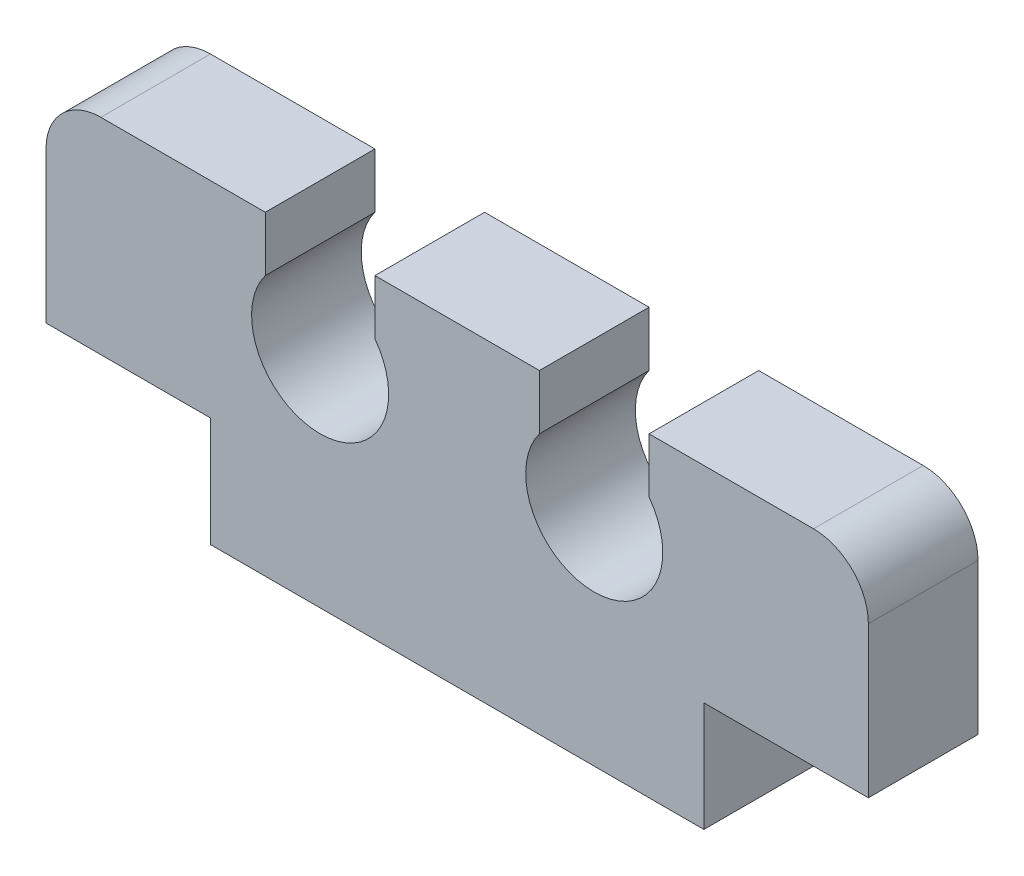
ISO-10303-21;
HEADER;
FILE_DESCRIPTION(('STEP AP214'),'2;1');
FILE_NAME('part.step','',(''),(''),'','','');
FILE_SCHEMA(('AUTOMOTIVE_DESIGN { 1 0 10303 214 1 1 1 1 }'));
ENDSEC;
DATA;
#1=APPLICATION_CONTEXT('core data for automotive mechanical design processes');
#2=APPLICATION_PROTOCOL_DEFINITION('international standard','automotive_design',2000,#1);
#3=PRODUCT_CONTEXT('',#1,'mechanical');
#4=PRODUCT('Part','Part','',(#3));
#5=PRODUCT_RELATED_PRODUCT_CATEGORY('part','',(#4));
#6=PRODUCT_DEFINITION_FORMATION('','',#4);
#7=PRODUCT_DEFINITION_CONTEXT('part definition',#1,'design');
#8=PRODUCT_DEFINITION('design','',#6,#7);
#9=PRODUCT_DEFINITION_SHAPE('','',#8);
#10=(LENGTH_UNIT() NAMED_UNIT(*) SI_UNIT(.MILLI.,.METRE.));
#11=(NAMED_UNIT(*) PLANE_ANGLE_UNIT() SI_UNIT($,.RADIAN.));
#12=(NAMED_UNIT(*) SI_UNIT($,.STERADIAN.) SOLID_ANGLE_UNIT());
#13=UNCERTAINTY_MEASURE_WITH_UNIT(LENGTH_MEASURE(1.E-05),#10,'distance_accuracy_value','');
#14=(GEOMETRIC_REPRESENTATION_CONTEXT(3) GLOBAL_UNCERTAINTY_ASSIGNED_CONTEXT((#13)) GLOBAL_UNIT_ASSIGNED_CONTEXT((#10,
#11,#12)) REPRESENTATION_CONTEXT('',''));
#15=CARTESIAN_POINT('',(0.,0.,0.));
#16=DIRECTION('',(0.,0.,1.));
#17=DIRECTION('',(1.,0.,0.));
#18=AXIS2_PLACEMENT_3D('',#15,#16,#17);
#19=CARTESIAN_POINT('',(-4.5,0.,2.));
#20=DIRECTION('',(1.,0.,0.));
#21=DIRECTION('',(0.,0.,-1.));
#22=AXIS2_PLACEMENT_3D('',#19,#20,#21);
#23=PLANE('',#22);
#24=DIRECTION('',(0.,-1.,0.));
#25=VECTOR('',#24,1.);
#26=CARTESIAN_POINT('',(-4.5,0.,0.));
#27=LINE('',#26,#25);
#28=CARTESIAN_POINT('',(-4.5,2.,0.));
#29=VERTEX_POINT('',#28);
#30=CARTESIAN_POINT('',(-4.5,0.,0.));
#31=VERTEX_POINT('',#30);
#32=EDGE_CURVE('E181',#29,#31,#27,.T.);
#33=ORIENTED_EDGE('',*,*,#32,.T.);
#34=DIRECTION('',(0.,0.,-1.));
#35=VECTOR('',#34,1.);
#36=CARTESIAN_POINT('',(-4.5,0.,2.));
#37=LINE('',#36,#35);
#38=CARTESIAN_POINT('',(-4.5,0.,2.));
#39=VERTEX_POINT('',#38);
#40=EDGE_CURVE('E162',#39,#31,#37,.T.);
#41=ORIENTED_EDGE('',*,*,#40,.F.);
#42=DIRECTION('',(0.,-1.,0.));
#43=VECTOR('',#42,1.);
#44=CARTESIAN_POINT('',(-4.5,0.,2.));
#45=LINE('',#44,#43);
#46=CARTESIAN_POINT('',(-4.5,2.,2.));
#47=VERTEX_POINT('',#46);
#48=EDGE_CURVE('E168',#47,#39,#45,.T.);
#49=ORIENTED_EDGE('',*,*,#48,.F.);
#50=DIRECTION('',(0.,0.,-1.));
#51=VECTOR('',#50,1.);
#52=CARTESIAN_POINT('',(-4.5,2.,2.));
#53=LINE('',#52,#51);
#54=EDGE_CURVE('E220',#47,#29,#53,.T.);
#55=ORIENTED_EDGE('',*,*,#54,.T.);
#56=EDGE_LOOP('',(#33,#41,#49,#55));
#57=FACE_BOUND('',#56,.T.);
#58=ADVANCED_FACE('F33',(#57),#23,.F.);
#59=CARTESIAN_POINT('',(-4.5,0.,2.));
#60=DIRECTION('',(0.,1.,0.));
#61=DIRECTION('',(-1.,0.,0.));
#62=AXIS2_PLACEMENT_3D('',#59,#60,#61);
#63=PLANE('',#62);
#64=DIRECTION('',(1.,0.,0.));
#65=VECTOR('',#64,1.);
#66=CARTESIAN_POINT('',(-4.5,0.,0.));
#67=LINE('',#66,#65);
#68=CARTESIAN_POINT('',(4.5,0.,0.));
#69=VERTEX_POINT('',#68);
#70=EDGE_CURVE('E268',#31,#69,#67,.T.);
#71=ORIENTED_EDGE('',*,*,#70,.T.);
#72=DIRECTION('',(0.,0.,-1.));
#73=VECTOR('',#72,1.);
#74=CARTESIAN_POINT('',(4.5,0.,2.));
#75=LINE('',#74,#73);
#76=CARTESIAN_POINT('',(4.5,0.,2.));
#77=VERTEX_POINT('',#76);
#78=EDGE_CURVE('E165',#77,#69,#75,.T.);
#79=ORIENTED_EDGE('',*,*,#78,.F.);
#80=DIRECTION('',(1.,0.,0.));
#81=VECTOR('',#80,1.);
#82=CARTESIAN_POINT('',(-4.5,0.,2.));
#83=LINE('',#82,#81);
#84=EDGE_CURVE('E158',#39,#77,#83,.T.);
#85=ORIENTED_EDGE('',*,*,#84,.F.);
#86=ORIENTED_EDGE('',*,*,#40,.T.);
#87=EDGE_LOOP('',(#71,#79,#85,#86));
#88=FACE_BOUND('',#87,.T.);
#89=ADVANCED_FACE('F160',(#88),#63,.F.);
#90=CARTESIAN_POINT('',(4.5,0.,2.));
#91=DIRECTION('',(-1.,0.,0.));
#92=DIRECTION('',(0.,0.,1.));
#93=AXIS2_PLACEMENT_3D('',#90,#91,#92);
#94=PLANE('',#93);
#95=DIRECTION('',(0.,1.,0.));
#96=VECTOR('',#95,1.);
#97=CARTESIAN_POINT('',(4.5,0.,0.));
#98=LINE('',#97,#96);
#99=CARTESIAN_POINT('',(4.5,2.,0.));
#100=VERTEX_POINT('',#99);
#101=EDGE_CURVE('E262',#69,#100,#98,.T.);
#102=ORIENTED_EDGE('',*,*,#101,.T.);
#103=DIRECTION('',(0.,0.,-1.));
#104=VECTOR('',#103,1.);
#105=CARTESIAN_POINT('',(4.5,2.,2.));
#106=LINE('',#105,#104);
#107=CARTESIAN_POINT('',(4.5,2.,2.));
#108=VERTEX_POINT('',#107);
#109=EDGE_CURVE('E187',#108,#100,#106,.T.);
#110=ORIENTED_EDGE('',*,*,#109,.F.);
#111=DIRECTION('',(0.,1.,0.));
#112=VECTOR('',#111,1.);
#113=CARTESIAN_POINT('',(4.5,0.,2.));
#114=LINE('',#113,#112);
#115=EDGE_CURVE('E167',#77,#108,#114,.T.);
#116=ORIENTED_EDGE('',*,*,#115,.F.);
#117=ORIENTED_EDGE('',*,*,#78,.T.);
#118=EDGE_LOOP('',(#102,#110,#116,#117));
#119=FACE_BOUND('',#118,.T.);
#120=ADVANCED_FACE('F301',(#119),#94,.F.);
#121=CARTESIAN_POINT('',(4.5,2.,2.));
#122=DIRECTION('',(0.,1.,0.));
#123=DIRECTION('',(0.,0.,1.));
#124=AXIS2_PLACEMENT_3D('',#121,#122,#123);
#125=PLANE('',#124);
#126=DIRECTION('',(1.,0.,0.));
#127=VECTOR('',#126,1.);
#128=CARTESIAN_POINT('',(4.5,2.,0.));
#129=LINE('',#128,#127);
#130=CARTESIAN_POINT('',(7.5,2.,0.));
#131=VERTEX_POINT('',#130);
#132=EDGE_CURVE('E257',#100,#131,#129,.T.);
#133=ORIENTED_EDGE('',*,*,#132,.T.);
#134=DIRECTION('',(0.,0.,-1.));
#135=VECTOR('',#134,1.);
#136=CARTESIAN_POINT('',(7.5,2.,2.));
#137=LINE('',#136,#135);
#138=CARTESIAN_POINT('',(7.5,2.,2.));
#139=VERTEX_POINT('',#138);
#140=EDGE_CURVE('E248',#139,#131,#137,.T.);
#141=ORIENTED_EDGE('',*,*,#140,.F.);
#142=DIRECTION('',(1.,0.,0.));
#143=VECTOR('',#142,1.);
#144=CARTESIAN_POINT('',(4.5,2.,2.));
#145=LINE('',#144,#143);
#146=EDGE_CURVE('E258',#108,#139,#145,.T.);
#147=ORIENTED_EDGE('',*,*,#146,.F.);
#148=ORIENTED_EDGE('',*,*,#109,.T.);
#149=EDGE_LOOP('',(#133,#141,#147,#148));
#150=FACE_BOUND('',#149,.T.);
#151=ADVANCED_FACE('F255',(#150),#125,.F.);
#152=CARTESIAN_POINT('',(7.5,2.,2.));
#153=DIRECTION('',(-1.,0.,0.));
#154=DIRECTION('',(0.,-1.,0.));
#155=AXIS2_PLACEMENT_3D('',#152,#153,#154);
#156=PLANE('',#155);
#157=DIRECTION('',(0.,1.,0.));
#158=VECTOR('',#157,1.);
#159=CARTESIAN_POINT('',(7.5,2.,0.));
#160=LINE('',#159,#158);
#161=CARTESIAN_POINT('',(7.5,4.75,0.));
#162=VERTEX_POINT('',#161);
#163=EDGE_CURVE('E264',#131,#162,#160,.T.);
#164=ORIENTED_EDGE('',*,*,#163,.T.);
#165=DIRECTION('',(0.,0.,-1.));
#166=VECTOR('',#165,1.);
#167=CARTESIAN_POINT('',(7.5,4.75,2.));
#168=LINE('',#167,#166);
#169=CARTESIAN_POINT('',(7.5,4.75,2.));
#170=VERTEX_POINT('',#169);
#171=EDGE_CURVE('E194',#162,#170,#168,.F.);
#172=ORIENTED_EDGE('',*,*,#171,.T.);
#173=DIRECTION('',(0.,1.,0.));
#174=VECTOR('',#173,1.);
#175=CARTESIAN_POINT('',(7.5,2.,2.));
#176=LINE('',#175,#174);
#177=EDGE_CURVE('E303',#139,#170,#176,.T.);
#178=ORIENTED_EDGE('',*,*,#177,.F.);
#179=ORIENTED_EDGE('',*,*,#140,.T.);
#180=EDGE_LOOP('',(#164,#172,#178,#179));
#181=FACE_BOUND('',#180,.T.);
#182=ADVANCED_FACE('F354',(#181),#156,.F.);
#183=CARTESIAN_POINT('',(7.5,5.75,2.));
#184=DIRECTION('',(0.,-1.,0.));
#185=DIRECTION('',(1.,0.,0.));
#186=AXIS2_PLACEMENT_3D('',#183,#184,#185);
#187=PLANE('',#186);
#188=DIRECTION('',(-1.,0.,0.));
#189=VECTOR('',#188,1.);
#190=CARTESIAN_POINT('',(7.5,5.75,2.));
#191=LINE('',#190,#189);
#192=CARTESIAN_POINT('',(6.5,5.75,2.));
#193=VERTEX_POINT('',#192);
#194=CARTESIAN_POINT('',(3.5,5.75,2.));
#195=VERTEX_POINT('',#194);
#196=EDGE_CURVE('E307',#193,#195,#191,.T.);
#197=ORIENTED_EDGE('',*,*,#196,.F.);
#198=DIRECTION('',(0.,0.,-1.));
#199=VECTOR('',#198,1.);
#200=CARTESIAN_POINT('',(6.5,5.75,2.));
#201=LINE('',#200,#199);
#202=CARTESIAN_POINT('',(6.5,5.75,0.));
#203=VERTEX_POINT('',#202);
#204=EDGE_CURVE('E182',#193,#203,#201,.T.);
#205=ORIENTED_EDGE('',*,*,#204,.T.);
#206=DIRECTION('',(-1.,0.,0.));
#207=VECTOR('',#206,1.);
#208=CARTESIAN_POINT('',(7.5,5.75,0.));
#209=LINE('',#208,#207);
#210=CARTESIAN_POINT('',(3.5,5.75,0.));
#211=VERTEX_POINT('',#210);
#212=EDGE_CURVE('E266',#203,#211,#209,.T.);
#213=ORIENTED_EDGE('',*,*,#212,.T.);
#214=DIRECTION('',(0.,0.,-1.));
#215=VECTOR('',#214,1.);
#216=CARTESIAN_POINT('',(3.5,5.75,2.));
#217=LINE('',#216,#215);
#218=EDGE_CURVE('E245',#195,#211,#217,.T.);
#219=ORIENTED_EDGE('',*,*,#218,.F.);
#220=EDGE_LOOP('',(#197,#205,#213,#219));
#221=FACE_BOUND('',#220,.T.);
#222=ADVANCED_FACE('F349',(#221),#187,.F.);
#223=CARTESIAN_POINT('',(3.5,4.75,2.));
#224=DIRECTION('',(1.,0.,0.));
#225=DIRECTION('',(0.,0.,-1.));
#226=AXIS2_PLACEMENT_3D('',#223,#224,#225);
#227=PLANE('',#226);
#228=DIRECTION('',(0.,-1.,0.));
#229=VECTOR('',#228,1.);
#230=CARTESIAN_POINT('',(3.5,4.75,0.));
#231=LINE('',#230,#229);
#232=CARTESIAN_POINT('',(3.5,4.75,0.));
#233=VERTEX_POINT('',#232);
#234=EDGE_CURVE('E273',#211,#233,#231,.T.);
#235=ORIENTED_EDGE('',*,*,#234,.T.);
#236=DIRECTION('',(0.,0.,-1.));
#237=VECTOR('',#236,1.);
#238=CARTESIAN_POINT('',(3.5,4.75,2.));
#239=LINE('',#238,#237);
#240=CARTESIAN_POINT('',(3.5,4.75,2.));
#241=VERTEX_POINT('',#240);
#242=EDGE_CURVE('E242',#241,#233,#239,.T.);
#243=ORIENTED_EDGE('',*,*,#242,.F.);
#244=DIRECTION('',(0.,-1.,0.));
#245=VECTOR('',#244,1.);
#246=CARTESIAN_POINT('',(3.5,4.75,2.));
#247=LINE('',#246,#245);
#248=EDGE_CURVE('E309',#195,#241,#247,.T.);
#249=ORIENTED_EDGE('',*,*,#248,.F.);
#250=ORIENTED_EDGE('',*,*,#218,.T.);
#251=EDGE_LOOP('',(#235,#243,#249,#250));
#252=FACE_BOUND('',#251,.T.);
#253=ADVANCED_FACE('F345',(#252),#227,.F.);
#254=CARTESIAN_POINT('',(2.5,4.,2.));
#255=DIRECTION('',(0.,0.,-1.));
#256=DIRECTION('',(-1.,0.,0.));
#257=AXIS2_PLACEMENT_3D('',#254,#255,#256);
#258=CYLINDRICAL_SURFACE('',#257,1.25);
#259=CARTESIAN_POINT('',(2.5,4.,0.));
#260=DIRECTION('',(0.,0.,-1.));
#261=DIRECTION('',(-1.,0.,0.));
#262=AXIS2_PLACEMENT_3D('',#259,#260,#261);
#263=CIRCLE('',#262,1.25);
#264=CARTESIAN_POINT('',(1.5,4.75,0.));
#265=VERTEX_POINT('',#264);
#266=EDGE_CURVE('E275',#233,#265,#263,.T.);
#267=ORIENTED_EDGE('',*,*,#266,.T.);
#268=DIRECTION('',(0.,0.,-1.));
#269=VECTOR('',#268,1.);
#270=CARTESIAN_POINT('',(1.5,4.75,2.));
#271=LINE('',#270,#269);
#272=CARTESIAN_POINT('',(1.5,4.75,2.));
#273=VERTEX_POINT('',#272);
#274=EDGE_CURVE('E239',#273,#265,#271,.T.);
#275=ORIENTED_EDGE('',*,*,#274,.F.);
#276=CARTESIAN_POINT('',(2.5,4.,2.));
#277=DIRECTION('',(0.,0.,-1.));
#278=DIRECTION('',(-1.,0.,0.));
#279=AXIS2_PLACEMENT_3D('',#276,#277,#278);
#280=CIRCLE('',#279,1.25);
#281=EDGE_CURVE('E311',#241,#273,#280,.T.);
#282=ORIENTED_EDGE('',*,*,#281,.F.);
#283=ORIENTED_EDGE('',*,*,#242,.T.);
#284=EDGE_LOOP('',(#267,#275,#282,#283));
#285=FACE_BOUND('',#284,.T.);
#286=ADVANCED_FACE('F340',(#285),#258,.F.);
#287=CARTESIAN_POINT('',(1.5,4.75,2.));
#288=DIRECTION('',(-1.,0.,0.));
#289=DIRECTION('',(0.,-1.,0.));
#290=AXIS2_PLACEMENT_3D('',#287,#288,#289);
#291=PLANE('',#290);
#292=DIRECTION('',(0.,1.,0.));
#293=VECTOR('',#292,1.);
#294=CARTESIAN_POINT('',(1.5,4.75,0.));
#295=LINE('',#294,#293);
#296=CARTESIAN_POINT('',(1.5,5.75,0.));
#297=VERTEX_POINT('',#296);
#298=EDGE_CURVE('E277',#265,#297,#295,.T.);
#299=ORIENTED_EDGE('',*,*,#298,.T.);
#300=DIRECTION('',(0.,0.,-1.));
#301=VECTOR('',#300,1.);
#302=CARTESIAN_POINT('',(1.5,5.75,2.));
#303=LINE('',#302,#301);
#304=CARTESIAN_POINT('',(1.5,5.75,2.));
#305=VERTEX_POINT('',#304);
#306=EDGE_CURVE('E236',#305,#297,#303,.T.);
#307=ORIENTED_EDGE('',*,*,#306,.F.);
#308=DIRECTION('',(0.,1.,0.));
#309=VECTOR('',#308,1.);
#310=CARTESIAN_POINT('',(1.5,4.75,2.));
#311=LINE('',#310,#309);
#312=EDGE_CURVE('E313',#273,#305,#311,.T.);
#313=ORIENTED_EDGE('',*,*,#312,.F.);
#314=ORIENTED_EDGE('',*,*,#274,.T.);
#315=EDGE_LOOP('',(#299,#307,#313,#314));
#316=FACE_BOUND('',#315,.T.);
#317=ADVANCED_FACE('F335',(#316),#291,.F.);
#318=CARTESIAN_POINT('',(-1.5,5.75,2.));
#319=DIRECTION('',(0.,-1.,0.));
#320=DIRECTION('',(0.,0.,-1.));
#321=AXIS2_PLACEMENT_3D('',#318,#319,#320);
#322=PLANE('',#321);
#323=DIRECTION('',(-1.,0.,0.));
#324=VECTOR('',#323,1.);
#325=CARTESIAN_POINT('',(-1.5,5.75,0.));
#326=LINE('',#325,#324);
#327=CARTESIAN_POINT('',(-1.5,5.75,0.));
#328=VERTEX_POINT('',#327);
#329=EDGE_CURVE('E279',#297,#328,#326,.T.);
#330=ORIENTED_EDGE('',*,*,#329,.T.);
#331=DIRECTION('',(0.,0.,-1.));
#332=VECTOR('',#331,1.);
#333=CARTESIAN_POINT('',(-1.5,5.75,2.));
#334=LINE('',#333,#332);
#335=CARTESIAN_POINT('',(-1.5,5.75,2.));
#336=VERTEX_POINT('',#335);
#337=EDGE_CURVE('E233',#336,#328,#334,.T.);
#338=ORIENTED_EDGE('',*,*,#337,.F.);
#339=DIRECTION('',(-1.,0.,0.));
#340=VECTOR('',#339,1.);
#341=CARTESIAN_POINT('',(-1.5,5.75,2.));
#342=LINE('',#341,#340);
#343=EDGE_CURVE('E315',#305,#336,#342,.T.);
#344=ORIENTED_EDGE('',*,*,#343,.F.);
#345=ORIENTED_EDGE('',*,*,#306,.T.);
#346=EDGE_LOOP('',(#330,#338,#344,#345));
#347=FACE_BOUND('',#346,.T.);
#348=ADVANCED_FACE('F331',(#347),#322,.F.);
#349=CARTESIAN_POINT('',(-1.5,4.75,2.));
#350=DIRECTION('',(1.,0.,0.));
#351=DIRECTION('',(0.,0.,-1.));
#352=AXIS2_PLACEMENT_3D('',#349,#350,#351);
#353=PLANE('',#352);
#354=DIRECTION('',(0.,-1.,0.));
#355=VECTOR('',#354,1.);
#356=CARTESIAN_POINT('',(-1.5,4.75,0.));
#357=LINE('',#356,#355);
#358=CARTESIAN_POINT('',(-1.5,4.75,0.));
#359=VERTEX_POINT('',#358);
#360=EDGE_CURVE('E281',#328,#359,#357,.T.);
#361=ORIENTED_EDGE('',*,*,#360,.T.);
#362=DIRECTION('',(0.,0.,-1.));
#363=VECTOR('',#362,1.);
#364=CARTESIAN_POINT('',(-1.5,4.75,2.));
#365=LINE('',#364,#363);
#366=CARTESIAN_POINT('',(-1.5,4.75,2.));
#367=VERTEX_POINT('',#366);
#368=EDGE_CURVE('E230',#367,#359,#365,.T.);
#369=ORIENTED_EDGE('',*,*,#368,.F.);
#370=DIRECTION('',(0.,-1.,0.));
#371=VECTOR('',#370,1.);
#372=CARTESIAN_POINT('',(-1.5,4.75,2.));
#373=LINE('',#372,#371);
#374=EDGE_CURVE('E317',#336,#367,#373,.T.);
#375=ORIENTED_EDGE('',*,*,#374,.F.);
#376=ORIENTED_EDGE('',*,*,#337,.T.);
#377=EDGE_LOOP('',(#361,#369,#375,#376));
#378=FACE_BOUND('',#377,.T.);
#379=ADVANCED_FACE('F327',(#378),#353,.F.);
#380=CARTESIAN_POINT('',(-2.5,4.,2.));
#381=DIRECTION('',(0.,0.,-1.));
#382=DIRECTION('',(-1.,0.,0.));
#383=AXIS2_PLACEMENT_3D('',#380,#381,#382);
#384=CYLINDRICAL_SURFACE('',#383,1.25);
#385=CARTESIAN_POINT('',(-2.5,4.,0.));
#386=DIRECTION('',(0.,0.,-1.));
#387=DIRECTION('',(1.,0.,0.));
#388=AXIS2_PLACEMENT_3D('',#385,#386,#387);
#389=CIRCLE('',#388,1.25);
#390=CARTESIAN_POINT('',(-3.5,4.75,0.));
#391=VERTEX_POINT('',#390);
#392=EDGE_CURVE('E283',#359,#391,#389,.T.);
#393=ORIENTED_EDGE('',*,*,#392,.T.);
#394=DIRECTION('',(0.,0.,-1.));
#395=VECTOR('',#394,1.);
#396=CARTESIAN_POINT('',(-3.5,4.75,2.));
#397=LINE('',#396,#395);
#398=CARTESIAN_POINT('',(-3.5,4.75,2.));
#399=VERTEX_POINT('',#398);
#400=EDGE_CURVE('E227',#399,#391,#397,.T.);
#401=ORIENTED_EDGE('',*,*,#400,.F.);
#402=CARTESIAN_POINT('',(-2.5,4.,2.));
#403=DIRECTION('',(0.,0.,-1.));
#404=DIRECTION('',(1.,0.,0.));
#405=AXIS2_PLACEMENT_3D('',#402,#403,#404);
#406=CIRCLE('',#405,1.25);
#407=EDGE_CURVE('E296',#367,#399,#406,.T.);
#408=ORIENTED_EDGE('',*,*,#407,.F.);
#409=ORIENTED_EDGE('',*,*,#368,.T.);
#410=EDGE_LOOP('',(#393,#401,#408,#409));
#411=FACE_BOUND('',#410,.T.);
#412=ADVANCED_FACE('F322',(#411),#384,.F.);
#413=CARTESIAN_POINT('',(-3.5,4.75,2.));
#414=DIRECTION('',(-1.,0.,0.));
#415=DIRECTION('',(0.,0.,1.));
#416=AXIS2_PLACEMENT_3D('',#413,#414,#415);
#417=PLANE('',#416);
#418=DIRECTION('',(0.,1.,0.));
#419=VECTOR('',#418,1.);
#420=CARTESIAN_POINT('',(-3.5,4.75,0.));
#421=LINE('',#420,#419);
#422=CARTESIAN_POINT('',(-3.5,5.75,0.));
#423=VERTEX_POINT('',#422);
#424=EDGE_CURVE('E216',#391,#423,#421,.T.);
#425=ORIENTED_EDGE('',*,*,#424,.T.);
#426=DIRECTION('',(0.,0.,-1.));
#427=VECTOR('',#426,1.);
#428=CARTESIAN_POINT('',(-3.5,5.75,2.));
#429=LINE('',#428,#427);
#430=CARTESIAN_POINT('',(-3.5,5.75,2.));
#431=VERTEX_POINT('',#430);
#432=EDGE_CURVE('E224',#431,#423,#429,.T.);
#433=ORIENTED_EDGE('',*,*,#432,.F.);
#434=DIRECTION('',(0.,1.,0.));
#435=VECTOR('',#434,1.);
#436=CARTESIAN_POINT('',(-3.5,4.75,2.));
#437=LINE('',#436,#435);
#438=EDGE_CURVE('E293',#399,#431,#437,.T.);
#439=ORIENTED_EDGE('',*,*,#438,.F.);
#440=ORIENTED_EDGE('',*,*,#400,.T.);
#441=EDGE_LOOP('',(#425,#433,#439,#440));
#442=FACE_BOUND('',#441,.T.);
#443=ADVANCED_FACE('F287',(#442),#417,.F.);
#444=CARTESIAN_POINT('',(-7.5,5.75,2.));
#445=DIRECTION('',(0.,-1.,0.));
#446=DIRECTION('',(0.,0.,-1.));
#447=AXIS2_PLACEMENT_3D('',#444,#445,#446);
#448=PLANE('',#447);
#449=DIRECTION('',(-1.,0.,0.));
#450=VECTOR('',#449,1.);
#451=CARTESIAN_POINT('',(-7.5,5.75,0.));
#452=LINE('',#451,#450);
#453=CARTESIAN_POINT('',(-6.5,5.75,0.));
#454=VERTEX_POINT('',#453);
#455=EDGE_CURVE('E213',#423,#454,#452,.T.);
#456=ORIENTED_EDGE('',*,*,#455,.T.);
#457=DIRECTION('',(0.,0.,-1.));
#458=VECTOR('',#457,1.);
#459=CARTESIAN_POINT('',(-6.5,5.75,2.));
#460=LINE('',#459,#458);
#461=CARTESIAN_POINT('',(-6.5,5.75,2.));
#462=VERTEX_POINT('',#461);
#463=EDGE_CURVE('E11',#454,#462,#460,.F.);
#464=ORIENTED_EDGE('',*,*,#463,.T.);
#465=DIRECTION('',(-1.,0.,0.));
#466=VECTOR('',#465,1.);
#467=CARTESIAN_POINT('',(-7.5,5.75,2.));
#468=LINE('',#467,#466);
#469=EDGE_CURVE('E292',#431,#462,#468,.T.);
#470=ORIENTED_EDGE('',*,*,#469,.F.);
#471=ORIENTED_EDGE('',*,*,#432,.T.);
#472=EDGE_LOOP('',(#456,#464,#470,#471));
#473=FACE_BOUND('',#472,.T.);
#474=ADVANCED_FACE('F291',(#473),#448,.F.);
#475=CARTESIAN_POINT('',(-7.5,2.,2.));
#476=DIRECTION('',(1.,0.,0.));
#477=DIRECTION('',(0.,0.,-1.));
#478=AXIS2_PLACEMENT_3D('',#475,#476,#477);
#479=PLANE('',#478);
#480=DIRECTION('',(0.,-1.,0.));
#481=VECTOR('',#480,1.);
#482=CARTESIAN_POINT('',(-7.5,2.,2.));
#483=LINE('',#482,#481);
#484=CARTESIAN_POINT('',(-7.5,4.75,2.));
#485=VERTEX_POINT('',#484);
#486=CARTESIAN_POINT('',(-7.5,2.,2.));
#487=VERTEX_POINT('',#486);
#488=EDGE_CURVE('E206',#485,#487,#483,.T.);
#489=ORIENTED_EDGE('',*,*,#488,.F.);
#490=DIRECTION('',(0.,0.,-1.));
#491=VECTOR('',#490,1.);
#492=CARTESIAN_POINT('',(-7.5,4.75,2.));
#493=LINE('',#492,#491);
#494=CARTESIAN_POINT('',(-7.5,4.75,0.));
#495=VERTEX_POINT('',#494);
#496=EDGE_CURVE('E41',#485,#495,#493,.T.);
#497=ORIENTED_EDGE('',*,*,#496,.T.);
#498=DIRECTION('',(0.,-1.,0.));
#499=VECTOR('',#498,1.);
#500=CARTESIAN_POINT('',(-7.5,2.,0.));
#501=LINE('',#500,#499);
#502=CARTESIAN_POINT('',(-7.5,2.,0.));
#503=VERTEX_POINT('',#502);
#504=EDGE_CURVE('E204',#495,#503,#501,.T.);
#505=ORIENTED_EDGE('',*,*,#504,.T.);
#506=DIRECTION('',(0.,0.,-1.));
#507=VECTOR('',#506,1.);
#508=CARTESIAN_POINT('',(-7.5,2.,2.));
#509=LINE('',#508,#507);
#510=EDGE_CURVE('E222',#487,#503,#509,.T.);
#511=ORIENTED_EDGE('',*,*,#510,.F.);
#512=EDGE_LOOP('',(#489,#497,#505,#511));
#513=FACE_BOUND('',#512,.T.);
#514=ADVANCED_FACE('F202',(#513),#479,.F.);
#515=CARTESIAN_POINT('',(-4.5,2.,2.));
#516=DIRECTION('',(0.,1.,0.));
#517=DIRECTION('',(-1.,0.,0.));
#518=AXIS2_PLACEMENT_3D('',#515,#516,#517);
#519=PLANE('',#518);
#520=DIRECTION('',(1.,0.,0.));
#521=VECTOR('',#520,1.);
#522=CARTESIAN_POINT('',(-4.5,2.,0.));
#523=LINE('',#522,#521);
#524=EDGE_CURVE('E178',#503,#29,#523,.T.);
#525=ORIENTED_EDGE('',*,*,#524,.T.);
#526=ORIENTED_EDGE('',*,*,#54,.F.);
#527=DIRECTION('',(1.,0.,0.));
#528=VECTOR('',#527,1.);
#529=CARTESIAN_POINT('',(-4.5,2.,2.));
#530=LINE('',#529,#528);
#531=EDGE_CURVE('E174',#487,#47,#530,.T.);
#532=ORIENTED_EDGE('',*,*,#531,.F.);
#533=ORIENTED_EDGE('',*,*,#510,.T.);
#534=EDGE_LOOP('',(#525,#526,#532,#533));
#535=FACE_BOUND('',#534,.T.);
#536=ADVANCED_FACE('F397',(#535),#519,.F.);
#537=CARTESIAN_POINT('',(-2.5,4.,2.));
#538=DIRECTION('',(0.,0.,1.));
#539=DIRECTION('',(1.,0.,0.));
#540=AXIS2_PLACEMENT_3D('',#537,#538,#539);
#541=PLANE('',#540);
#542=ORIENTED_EDGE('',*,*,#177,.T.);
#543=CARTESIAN_POINT('',(6.5,4.75,2.));
#544=DIRECTION('',(0.,0.,1.));
#545=DIRECTION('',(1.,0.,0.));
#546=AXIS2_PLACEMENT_3D('',#543,#544,#545);
#547=CIRCLE('',#546,1.);
#548=EDGE_CURVE('E197',#170,#193,#547,.T.);
#549=ORIENTED_EDGE('',*,*,#548,.T.);
#550=ORIENTED_EDGE('',*,*,#196,.T.);
#551=ORIENTED_EDGE('',*,*,#248,.T.);
#552=ORIENTED_EDGE('',*,*,#281,.T.);
#553=ORIENTED_EDGE('',*,*,#312,.T.);
#554=ORIENTED_EDGE('',*,*,#343,.T.);
#555=ORIENTED_EDGE('',*,*,#374,.T.);
#556=ORIENTED_EDGE('',*,*,#407,.T.);
#557=ORIENTED_EDGE('',*,*,#438,.T.);
#558=ORIENTED_EDGE('',*,*,#469,.T.);
#559=CARTESIAN_POINT('',(-6.5,4.75,2.));
#560=DIRECTION('',(0.,0.,1.));
#561=DIRECTION('',(1.,0.,0.));
#562=AXIS2_PLACEMENT_3D('',#559,#560,#561);
#563=CIRCLE('',#562,1.);
#564=EDGE_CURVE('E48',#462,#485,#563,.T.);
#565=ORIENTED_EDGE('',*,*,#564,.T.);
#566=ORIENTED_EDGE('',*,*,#488,.T.);
#567=ORIENTED_EDGE('',*,*,#531,.T.);
#568=ORIENTED_EDGE('',*,*,#48,.T.);
#569=ORIENTED_EDGE('',*,*,#84,.T.);
#570=ORIENTED_EDGE('',*,*,#115,.T.);
#571=ORIENTED_EDGE('',*,*,#146,.T.);
#572=EDGE_LOOP('',(#542,#549,#550,#551,#552,#553,#554,#555,#556,#557,#558,#565,#566,#567,#568,
#569,#570,#571));
#573=FACE_BOUND('',#572,.T.);
#574=ADVANCED_FACE('F172',(#573),#541,.T.);
#575=CARTESIAN_POINT('',(-2.5,4.,0.));
#576=DIRECTION('',(0.,0.,1.));
#577=DIRECTION('',(1.,0.,0.));
#578=AXIS2_PLACEMENT_3D('',#575,#576,#577);
#579=PLANE('',#578);
#580=ORIENTED_EDGE('',*,*,#212,.F.);
#581=CARTESIAN_POINT('',(6.5,4.75,0.));
#582=DIRECTION('',(0.,0.,1.));
#583=DIRECTION('',(1.,0.,0.));
#584=AXIS2_PLACEMENT_3D('',#581,#582,#583);
#585=CIRCLE('',#584,1.);
#586=EDGE_CURVE('E192',#203,#162,#585,.F.);
#587=ORIENTED_EDGE('',*,*,#586,.T.);
#588=ORIENTED_EDGE('',*,*,#163,.F.);
#589=ORIENTED_EDGE('',*,*,#132,.F.);
#590=ORIENTED_EDGE('',*,*,#101,.F.);
#591=ORIENTED_EDGE('',*,*,#70,.F.);
#592=ORIENTED_EDGE('',*,*,#32,.F.);
#593=ORIENTED_EDGE('',*,*,#524,.F.);
#594=ORIENTED_EDGE('',*,*,#504,.F.);
#595=CARTESIAN_POINT('',(-6.5,4.75,0.));
#596=DIRECTION('',(0.,0.,1.));
#597=DIRECTION('',(1.,0.,0.));
#598=AXIS2_PLACEMENT_3D('',#595,#596,#597);
#599=CIRCLE('',#598,1.);
#600=EDGE_CURVE('E185',#495,#454,#599,.F.);
#601=ORIENTED_EDGE('',*,*,#600,.T.);
#602=ORIENTED_EDGE('',*,*,#455,.F.);
#603=ORIENTED_EDGE('',*,*,#424,.F.);
#604=ORIENTED_EDGE('',*,*,#392,.F.);
#605=ORIENTED_EDGE('',*,*,#360,.F.);
#606=ORIENTED_EDGE('',*,*,#329,.F.);
#607=ORIENTED_EDGE('',*,*,#298,.F.);
#608=ORIENTED_EDGE('',*,*,#266,.F.);
#609=ORIENTED_EDGE('',*,*,#234,.F.);
#610=EDGE_LOOP('',(#580,#587,#588,#589,#590,#591,#592,#593,#594,#601,#602,#603,#604,#605,#606,
#607,#608,#609));
#611=FACE_BOUND('',#610,.T.);
#612=ADVANCED_FACE('F211',(#611),#579,.F.);
#613=CARTESIAN_POINT('',(6.5,4.75,2.));
#614=DIRECTION('',(0.,0.,-1.));
#615=DIRECTION('',(-1.,0.,0.));
#616=AXIS2_PLACEMENT_3D('',#613,#614,#615);
#617=CYLINDRICAL_SURFACE('',#616,1.);
#618=ORIENTED_EDGE('',*,*,#548,.F.);
#619=ORIENTED_EDGE('',*,*,#171,.F.);
#620=ORIENTED_EDGE('',*,*,#586,.F.);
#621=ORIENTED_EDGE('',*,*,#204,.F.);
#622=EDGE_LOOP('',(#618,#619,#620,#621));
#623=FACE_BOUND('',#622,.T.);
#624=ADVANCED_FACE('F357',(#623),#617,.T.);
#625=CARTESIAN_POINT('',(-6.5,4.75,2.));
#626=DIRECTION('',(0.,0.,-1.));
#627=DIRECTION('',(-1.,0.,0.));
#628=AXIS2_PLACEMENT_3D('',#625,#626,#627);
#629=CYLINDRICAL_SURFACE('',#628,1.);
#630=ORIENTED_EDGE('',*,*,#564,.F.);
#631=ORIENTED_EDGE('',*,*,#463,.F.);
#632=ORIENTED_EDGE('',*,*,#600,.F.);
#633=ORIENTED_EDGE('',*,*,#496,.F.);
#634=EDGE_LOOP('',(#630,#631,#632,#633));
#635=FACE_BOUND('',#634,.T.);
#636=ADVANCED_FACE('F35',(#635),#629,.T.);
#637=CLOSED_SHELL('',(#58,#89,#120,#151,#182,#222,#253,#286,#317,#348,#379,#412,#443,#474,#514,
#536,#574,#612,#624,#636));
#638=MANIFOLD_SOLID_BREP('B2',#637);
#639=ADVANCED_BREP_SHAPE_REPRESENTATION('',(#18,#638),#14);
#640=SHAPE_DEFINITION_REPRESENTATION(#9,#639);
ENDSEC;
END-ISO-10303-21;
